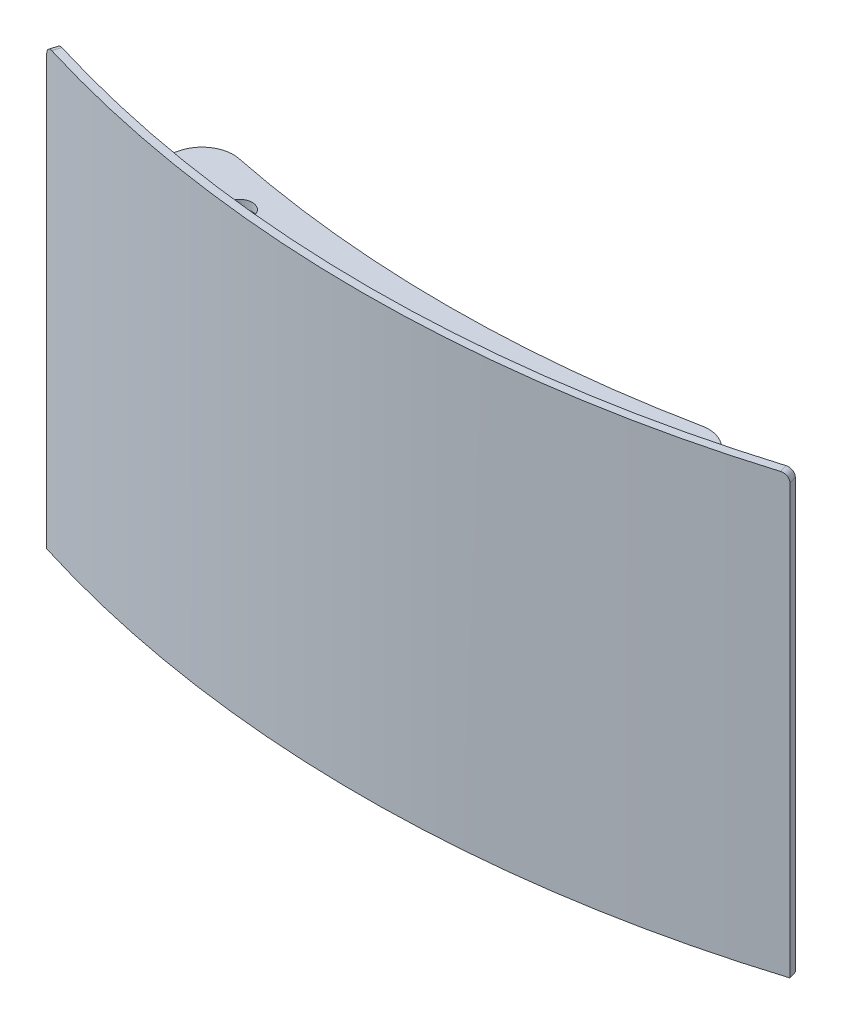
ISO-10303-21;
HEADER;
FILE_DESCRIPTION(('STEP AP214'),'2;1');
FILE_NAME('part.step','',(''),(''),'','','');
FILE_SCHEMA(('AUTOMOTIVE_DESIGN { 1 0 10303 214 1 1 1 1 }'));
ENDSEC;
DATA;
#1=APPLICATION_CONTEXT('core data for automotive mechanical design processes');
#2=APPLICATION_PROTOCOL_DEFINITION('international standard','automotive_design',2000,#1);
#3=PRODUCT_CONTEXT('',#1,'mechanical');
#4=PRODUCT('Part','Part','',(#3));
#5=PRODUCT_RELATED_PRODUCT_CATEGORY('part','',(#4));
#6=PRODUCT_DEFINITION_FORMATION('','',#4);
#7=PRODUCT_DEFINITION_CONTEXT('part definition',#1,'design');
#8=PRODUCT_DEFINITION('design','',#6,#7);
#9=PRODUCT_DEFINITION_SHAPE('','',#8);
#10=(LENGTH_UNIT() NAMED_UNIT(*) SI_UNIT(.MILLI.,.METRE.));
#11=(NAMED_UNIT(*) PLANE_ANGLE_UNIT() SI_UNIT($,.RADIAN.));
#12=(NAMED_UNIT(*) SI_UNIT($,.STERADIAN.) SOLID_ANGLE_UNIT());
#13=UNCERTAINTY_MEASURE_WITH_UNIT(LENGTH_MEASURE(1.E-05),#10,'distance_accuracy_value','');
#14=(GEOMETRIC_REPRESENTATION_CONTEXT(3) GLOBAL_UNCERTAINTY_ASSIGNED_CONTEXT((#13)) GLOBAL_UNIT_ASSIGNED_CONTEXT((#10,
#11,#12)) REPRESENTATION_CONTEXT('',''));
#15=CARTESIAN_POINT('',(0.,0.,0.));
#16=DIRECTION('',(0.,0.,1.));
#17=DIRECTION('',(1.,0.,0.));
#18=AXIS2_PLACEMENT_3D('',#15,#16,#17);
#19=CARTESIAN_POINT('',(76.2,233.685738606675,-242.300557159904));
#20=DIRECTION('',(0.,1.,0.));
#21=DIRECTION('',(0.,0.,1.));
#22=AXIS2_PLACEMENT_3D('',#19,#20,#21);
#23=CYLINDRICAL_SURFACE('',#22,253.238);
#24=CARTESIAN_POINT('',(76.2,466.09,-242.300557159904));
#25=DIRECTION('',(0.,1.,0.));
#26=DIRECTION('',(0.,0.,1.));
#27=AXIS2_PLACEMENT_3D('',#24,#25,#26);
#28=CIRCLE('',#27,253.238);
#29=CARTESIAN_POINT('',(19.4038398421802,466.09,4.48615406119721));
#30=VERTEX_POINT('',#29);
#31=CARTESIAN_POINT('',(132.797914432867,466.09,4.53169503953971));
#32=VERTEX_POINT('',#31);
#33=EDGE_CURVE('E239',#30,#32,#28,.T.);
#34=ORIENTED_EDGE('',*,*,#33,.T.);
#35=DIRECTION('',(0.,1.,0.));
#36=VECTOR('',#35,1.);
#37=CARTESIAN_POINT('',(132.797914432867,466.09,4.53169503953971));
#38=LINE('',#37,#36);
#39=CARTESIAN_POINT('',(132.797914432867,467.741,4.53169503953971));
#40=VERTEX_POINT('',#39);
#41=EDGE_CURVE('E229',#32,#40,#38,.T.);
#42=ORIENTED_EDGE('',*,*,#41,.T.);
#43=CARTESIAN_POINT('',(76.2,467.741,-242.300557159904));
#44=DIRECTION('',(0.,1.,0.));
#45=DIRECTION('',(0.,0.,1.));
#46=AXIS2_PLACEMENT_3D('',#43,#44,#45);
#47=CIRCLE('',#46,253.238);
#48=CARTESIAN_POINT('',(19.4038398421802,467.741,4.48615406119721));
#49=VERTEX_POINT('',#48);
#50=EDGE_CURVE('E233',#49,#40,#47,.T.);
#51=ORIENTED_EDGE('',*,*,#50,.F.);
#52=DIRECTION('',(0.,1.,0.));
#53=VECTOR('',#52,1.);
#54=CARTESIAN_POINT('',(19.4038398421802,233.685738606675,4.48615406119715));
#55=LINE('',#54,#53);
#56=EDGE_CURVE('E237',#30,#49,#55,.T.);
#57=ORIENTED_EDGE('',*,*,#56,.F.);
#58=EDGE_LOOP('',(#34,#42,#51,#57));
#59=FACE_BOUND('',#58,.T.);
#60=CARTESIAN_POINT('',(149.984613474908,478.78999680348,-0.0500350585918926));
#61=CARTESIAN_POINT('',(150.025635055923,478.79008434453,-0.062529339373361));
#62=CARTESIAN_POINT('',(150.066637317999,478.788361503138,-0.0750292643590371));
#63=CARTESIAN_POINT('',(150.14834923114,478.781313073592,-0.0999623829842916));
#64=CARTESIAN_POINT('',(150.189058896062,478.77598765722,-0.112395579777194));
#65=CARTESIAN_POINT('',(150.310236790901,478.754658465446,-0.149437923913108));
#66=CARTESIAN_POINT('',(150.389894762352,478.733301902024,-0.173832726889426));
#67=CARTESIAN_POINT('',(150.544613178669,478.676910613018,-0.221293890648153));
#68=CARTESIAN_POINT('',(150.619672225455,478.641871751632,-0.244359847333555));
#69=CARTESIAN_POINT('',(150.763086073832,478.559111342516,-0.288498639088332));
#70=CARTESIAN_POINT('',(150.831441661865,478.511391284971,-0.309571707950718));
#71=CARTESIAN_POINT('',(150.959518749024,478.404614372938,-0.349108510946142));
#72=CARTESIAN_POINT('',(151.019239101239,478.345556014942,-0.367571898460062));
#73=CARTESIAN_POINT('',(151.12834994497,478.217783792492,-0.401342014173826));
#74=CARTESIAN_POINT('',(151.177740432315,478.149069924139,-0.416648741098954));
#75=CARTESIAN_POINT('',(151.264791972761,478.003937603599,-0.443649598218896));
#76=CARTESIAN_POINT('',(151.30245371482,477.92751960431,-0.455343940608326));
#77=CARTESIAN_POINT('',(151.364992577912,477.769150419986,-0.474773563375211));
#78=CARTESIAN_POINT('',(151.389868202704,477.687198588646,-0.48250838040535));
#79=CARTESIAN_POINT('',(151.426114963946,477.520079612128,-0.49378173783047));
#80=CARTESIAN_POINT('',(151.437492476828,477.434914004753,-0.497322259586185));
#81=CARTESIAN_POINT('',(151.444215475846,477.306623775637,-0.499414319160306));
#82=CARTESIAN_POINT('',(151.444728636867,477.263733507965,-0.499573986092211));
#83=CARTESIAN_POINT('',(151.442305250064,477.178057883009,-0.498819903074743));
#84=CARTESIAN_POINT('',(151.439368536493,477.135272530865,-0.497906101550513));
#85=CARTESIAN_POINT('',(151.43471238162,477.092672643926,-0.496457325234673));
#86=B_SPLINE_CURVE_WITH_KNOTS('',3,(#60,#61,#62,#63,#64,#65,#66,#67,#68,#69,#70,#71,#72,#73,#74,
#75,#76,#77,#78,#79,#80,#81,#82,#83,#84,#85),.UNSPECIFIED.,.F.,.F.,(4,2,2,2,2,2,2,2,2,2,2,2,4),
(0.,0.128567636647668,0.257129143208204,0.513816086453091,0.770580679593902,1.0273151132709,
1.28408361455845,1.54085221953341,1.79760573882733,2.05438929679089,2.31105150326006,
2.43960053385237,2.56815574084342),.UNSPECIFIED.);
#87=CARTESIAN_POINT('',(149.98759953634,478.79,-0.0509445726708524));
#88=VERTEX_POINT('',#87);
#89=CARTESIAN_POINT('',(151.444154395946,477.266,-0.499395307362677));
#90=VERTEX_POINT('',#89);
#91=EDGE_CURVE('E128',#88,#90,#86,.T.);
#92=ORIENTED_EDGE('',*,*,#91,.T.);
#93=DIRECTION('',(0.,1.,0.));
#94=VECTOR('',#93,1.);
#95=CARTESIAN_POINT('',(151.444154395946,387.35,-0.499395307362677));
#96=LINE('',#95,#94);
#97=CARTESIAN_POINT('',(151.444154395946,389.89,-0.499395307362677));
#98=VERTEX_POINT('',#97);
#99=EDGE_CURVE('E122',#98,#90,#96,.T.);
#100=ORIENTED_EDGE('',*,*,#99,.F.);
#101=CARTESIAN_POINT('',(76.2,389.89,-242.300557159904));
#102=DIRECTION('',(0.,1.,0.));
#103=DIRECTION('',(0.,0.,1.));
#104=AXIS2_PLACEMENT_3D('',#101,#102,#103);
#105=CIRCLE('',#104,253.238);
#106=CARTESIAN_POINT('',(0.955845604053498,389.89,-0.499395307362704));
#107=VERTEX_POINT('',#106);
#108=EDGE_CURVE('E112',#107,#98,#105,.T.);
#109=ORIENTED_EDGE('',*,*,#108,.F.);
#110=DIRECTION('',(0.,1.,0.));
#111=VECTOR('',#110,1.);
#112=CARTESIAN_POINT('',(0.955845604053498,233.685738606675,-0.499395307362704));
#113=LINE('',#112,#111);
#114=CARTESIAN_POINT('',(0.955845604053512,477.266,-0.499395307362732));
#115=VERTEX_POINT('',#114);
#116=EDGE_CURVE('E134',#107,#115,#113,.T.);
#117=ORIENTED_EDGE('',*,*,#116,.T.);
#118=CARTESIAN_POINT('',(1.27601405075767,478.219638997539,-0.399997066551482));
#119=CARTESIAN_POINT('',(1.32718518822246,478.286409313736,-0.384147815834058));
#120=CARTESIAN_POINT('',(1.38378494189357,478.348704344154,-0.366634946235441));
#121=CARTESIAN_POINT('',(1.5062362107472,478.46251369786,-0.328801786420707));
#122=CARTESIAN_POINT('',(1.57209878280915,478.514014951105,-0.308478141515813));
#123=CARTESIAN_POINT('',(1.71114651502427,478.604691984424,-0.265641018824731));
#124=CARTESIAN_POINT('',(1.78432816235252,478.643873640283,-0.24312859169817));
#125=CARTESIAN_POINT('',(1.93594291920636,478.708815246287,-0.196569685131521));
#126=CARTESIAN_POINT('',(2.01437471986905,478.734578527672,-0.172523588105259));
#127=CARTESIAN_POINT('',(2.17429481142865,478.771972070359,-0.123583430832557));
#128=CARTESIAN_POINT('',(2.25578346002694,478.78360067232,-0.0986892713803987));
#129=CARTESIAN_POINT('',(2.41950004042234,478.792389158725,-0.0487670881155456));
#130=CARTESIAN_POINT('',(2.50172800129296,478.789548471656,-0.0237390590542363));
#131=CARTESIAN_POINT('',(2.66458778292469,478.769478013816,0.0257415350907573));
#132=CARTESIAN_POINT('',(2.74521956317143,478.752247878288,0.0501940855705685));
#133=CARTESIAN_POINT('',(2.90259348602752,478.703887372841,0.0978372371459949));
#134=CARTESIAN_POINT('',(2.97933563506682,478.672757025902,0.121027840327737));
#135=CARTESIAN_POINT('',(3.12675152522381,478.597477900204,0.165504250914672));
#136=CARTESIAN_POINT('',(3.1974249709338,478.553328488178,0.186789965597287));
#137=CARTESIAN_POINT('',(3.33068722546518,478.453264914841,0.226869638665179));
#138=CARTESIAN_POINT('',(3.39327604816833,478.397350773732,0.245663601328938));
#139=CARTESIAN_POINT('',(3.50858570141607,478.275344704856,0.28024703383554));
#140=CARTESIAN_POINT('',(3.56130655497023,478.209252800822,0.296036510684076));
#141=CARTESIAN_POINT('',(3.65537695509811,478.068766921911,0.324183396468107));
#142=CARTESIAN_POINT('',(3.69672649425454,477.994372941619,0.336540803164932));
#143=CARTESIAN_POINT('',(3.7668713739315,477.839400670869,0.357490034160984));
#144=CARTESIAN_POINT('',(3.79566765839612,477.758822845942,0.366082141592776));
#145=CARTESIAN_POINT('',(3.83988821305529,477.593765535907,0.379271839505266));
#146=CARTESIAN_POINT('',(3.85531249696114,477.509286054802,0.383869434081832));
#147=CARTESIAN_POINT('',(3.87234760369914,477.338832271281,0.388946988222835));
#148=CARTESIAN_POINT('',(3.8739597615106,477.252858114136,0.389427345729364));
#149=CARTESIAN_POINT('',(3.86332806355898,477.081847752047,0.386258647584373));
#150=CARTESIAN_POINT('',(3.85108420994752,476.996811546958,0.382609592574084));
#151=CARTESIAN_POINT('',(3.81309089778668,476.830093934232,0.371279738301627));
#152=CARTESIAN_POINT('',(3.78734189451704,476.748412413604,0.363599074951281));
#153=CARTESIAN_POINT('',(3.72307376717454,476.59071941955,0.344411726828827));
#154=CARTESIAN_POINT('',(3.68455463982346,476.514707947581,0.33290504107454));
#155=CARTESIAN_POINT('',(3.59584269164013,476.370507646648,0.306374152811633));
#156=CARTESIAN_POINT('',(3.54564915930766,476.302319294846,0.291349735913432));
#157=CARTESIAN_POINT('',(3.43502098932941,476.175705448165,0.258189949388763));
#158=CARTESIAN_POINT('',(3.37458634528645,476.117279959386,0.240054577819022));
#159=CARTESIAN_POINT('',(3.24519136793839,476.011844308814,0.201164683696954));
#160=CARTESIAN_POINT('',(3.17623019061304,475.964835278476,0.180409901851519));
#161=CARTESIAN_POINT('',(3.03175027454318,475.883574086785,0.136852415405017));
#162=CARTESIAN_POINT('',(2.95623153437357,475.849321928205,0.114049710358891));
#163=CARTESIAN_POINT('',(2.80078045526483,475.794545177987,0.0670269003498573));
#164=CARTESIAN_POINT('',(2.72084787855317,475.774021326674,0.0428067190235571));
#165=CARTESIAN_POINT('',(2.55884483084638,475.747286989836,-0.00637218534122177));
#166=CARTESIAN_POINT('',(2.47677435913571,475.741076509101,-0.0313309086268846));
#167=CARTESIAN_POINT('',(2.31282777507882,475.743145582677,-0.0812809491473035));
#168=CARTESIAN_POINT('',(2.23095165933814,475.751424882029,-0.106272265800822));
#169=CARTESIAN_POINT('',(2.06971565357482,475.782238381416,-0.155574356621849));
#170=CARTESIAN_POINT('',(1.99035576021326,475.804772562536,-0.1798851316924));
#171=CARTESIAN_POINT('',(1.83640596080783,475.863454898694,-0.227124057438863));
#172=CARTESIAN_POINT('',(1.76181581084923,475.899602356926,-0.250052278812258));
#173=CARTESIAN_POINT('',(1.61951363426209,475.984485507616,-0.293860460380876));
#174=CARTESIAN_POINT('',(1.55180161866555,476.033221220265,-0.314740417290835));
#175=CARTESIAN_POINT('',(1.42517460010667,476.141895340762,-0.353838790365762));
#176=CARTESIAN_POINT('',(1.3662592640648,476.201833324252,-0.372057307303551));
#177=CARTESIAN_POINT('',(1.2588884371964,476.331211911111,-0.405295509520559));
#178=CARTESIAN_POINT('',(1.21043296677717,476.400652533021,-0.420315188558816));
#179=CARTESIAN_POINT('',(1.12535094231252,476.547065678415,-0.446709341186652));
#180=CARTESIAN_POINT('',(1.08872449516359,476.624038269956,-0.458083781834942));
#181=CARTESIAN_POINT('',(1.02833694300876,476.783326773314,-0.476847149847997));
#182=CARTESIAN_POINT('',(1.0045753332599,476.865642475357,-0.484236233575433));
#183=CARTESIAN_POINT('',(0.970587430682216,477.033273993611,-0.494807747725036));
#184=CARTESIAN_POINT('',(0.960359750715976,477.118589501442,-0.497990609256844));
#185=CARTESIAN_POINT('',(0.953724533917358,477.289831244264,-0.50005532976753));
#186=CARTESIAN_POINT('',(0.957320431744127,477.375757625739,-0.498936119837242));
#187=CARTESIAN_POINT('',(0.978237858017621,477.545791754372,-0.492428136116246));
#188=CARTESIAN_POINT('',(0.995565962814057,477.62989861033,-0.487037316653192));
#189=CARTESIAN_POINT('',(1.04345897466009,477.793797077617,-0.472147726626133));
#190=CARTESIAN_POINT('',(1.07400793821866,477.873593756775,-0.46265390403462));
#191=CARTESIAN_POINT('',(1.13363682358356,477.997901253199,-0.444140393066684));
#192=CARTESIAN_POINT('',(1.15897202181626,478.044423242975,-0.43627786970847));
#193=CARTESIAN_POINT('',(1.214169279329,478.134425901235,-0.419159213639868));
#194=CARTESIAN_POINT('',(1.24403133863116,478.177906569703,-0.409903080922671));
#195=CARTESIAN_POINT('',(1.27601405075767,478.219638997539,-0.399997066551482));
#196=B_SPLINE_CURVE_WITH_KNOTS('',3,(#118,#119,#120,#121,#122,#123,#124,#125,#126,#127,#128,
#129,#130,#131,#132,#133,#134,#135,#136,#137,#138,#139,#140,#141,#142,#143,#144,#145,#146,#147,
#148,#149,#150,#151,#152,#153,#154,#155,#156,#157,#158,#159,#160,#161,#162,#163,#164,#165,#166,
#167,#168,#169,#170,#171,#172,#173,#174,#175,#176,#177,#178,#179,#180,#181,#182,#183,#184,#185,
#186,#187,#188,#189,#190,#191,#192,#193,#194,#195),.UNSPECIFIED.,.T.,.F.,(4,2,2,2,2,2,2,2,2,2,2,
2,2,2,2,2,2,2,2,2,2,2,2,2,2,2,2,2,2,2,2,2,2,2,2,2,2,2,4),(0.,0.256615211948305,
0.513539383163429,0.770340828835658,1.02707849065314,1.28384628928317,1.54062422987672,
1.79740867969215,2.05419270500403,2.3109892227746,2.56778529960496,2.82458077764518,
3.08137642318751,3.3381527556061,3.59492882473276,3.85168007547833,4.10843128635453,
4.36517384230174,4.62191646415749,4.87867473737362,5.13543317097563,5.39221704083224,
5.64900096649372,5.90579873857683,6.16259659660911,6.41938993613199,6.67618293488712,
6.93296279126571,7.18974305949329,7.44651360246569,7.70328464639516,7.96005801064767,
8.2168212998452,8.47355827048137,8.73035903509215,8.98728285588306,9.24389770295236,
9.4042859768415,9.56467425151438),.UNSPECIFIED.);
#197=CARTESIAN_POINT('',(2.41240046365943,478.79,-0.0509445726708246));
#198=VERTEX_POINT('',#197);
#199=EDGE_CURVE('E147',#115,#198,#196,.T.);
#200=ORIENTED_EDGE('',*,*,#199,.T.);
#201=CARTESIAN_POINT('',(76.2,478.79,-242.300557159904));
#202=DIRECTION('',(0.,1.,0.));
#203=DIRECTION('',(0.,0.,1.));
#204=AXIS2_PLACEMENT_3D('',#201,#202,#203);
#205=CIRCLE('',#204,253.238);
#206=EDGE_CURVE('E219',#88,#198,#205,.F.);
#207=ORIENTED_EDGE('',*,*,#206,.F.);
#208=EDGE_LOOP('',(#92,#100,#109,#117,#200,#207));
#209=FACE_BOUND('',#208,.T.);
#210=ADVANCED_FACE('F39',(#59,#209),#23,.F.);
#211=CARTESIAN_POINT('',(151.21589832852,233.685738606675,-1.22520334295942));
#212=DIRECTION('',(0.95393920141695,0.,-0.299999999999987));
#213=DIRECTION('',(-0.299999999999987,0.,-0.95393920141695));
#214=AXIS2_PLACEMENT_3D('',#211,#212,#213);
#215=PLANE('',#214);
#216=ORIENTED_EDGE('',*,*,#99,.T.);
#217=DIRECTION('',(-0.299999999999987,0.,-0.95393920141695));
#218=VECTOR('',#217,1.);
#219=CARTESIAN_POINT('',(151.21589832852,477.266,-1.22520334295942));
#220=LINE('',#219,#218);
#221=CARTESIAN_POINT('',(151.939456623721,477.266,1.07556539804829));
#222=VERTEX_POINT('',#221);
#223=EDGE_CURVE('E153',#90,#222,#220,.F.);
#224=ORIENTED_EDGE('',*,*,#223,.T.);
#225=DIRECTION('',(0.,1.,0.));
#226=VECTOR('',#225,1.);
#227=CARTESIAN_POINT('',(151.939456623721,233.685738606675,1.07556539804829));
#228=LINE('',#227,#226);
#229=CARTESIAN_POINT('',(151.939456623721,389.89,1.07556539804829));
#230=VERTEX_POINT('',#229);
#231=EDGE_CURVE('E125',#230,#222,#228,.T.);
#232=ORIENTED_EDGE('',*,*,#231,.F.);
#233=DIRECTION('',(0.299999999999987,0.,0.95393920141695));
#234=VECTOR('',#233,1.);
#235=CARTESIAN_POINT('',(151.21589832852,389.89,-1.22520334295942));
#236=LINE('',#235,#234);
#237=EDGE_CURVE('E43',#98,#230,#236,.T.);
#238=ORIENTED_EDGE('',*,*,#237,.F.);
#239=EDGE_LOOP('',(#216,#224,#232,#238));
#240=FACE_BOUND('',#239,.T.);
#241=ADVANCED_FACE('F121',(#240),#215,.T.);
#242=CARTESIAN_POINT('',(76.2,233.685738606675,-242.300557159904));
#243=DIRECTION('',(0.,1.,0.));
#244=DIRECTION('',(0.,0.,1.));
#245=AXIS2_PLACEMENT_3D('',#242,#243,#244);
#246=CYLINDRICAL_SURFACE('',#245,254.889);
#247=ORIENTED_EDGE('',*,*,#231,.T.);
#248=CARTESIAN_POINT('',(151.939456623721,477.266,1.07556539804829));
#249=CARTESIAN_POINT('',(151.939456332719,477.308877124114,1.07556542306595));
#250=CARTESIAN_POINT('',(151.937727769913,477.35173370679,1.07610343024965));
#251=CARTESIAN_POINT('',(151.930831708128,477.437140197982,1.07824937244954));
#252=CARTESIAN_POINT('',(151.925664374078,477.479690121107,1.07985725615261));
#253=CARTESIAN_POINT('',(151.905053058295,477.606348338713,1.08626968855139));
#254=CARTESIAN_POINT('',(151.88449962778,477.689608224061,1.09266306404891));
#255=CARTESIAN_POINT('',(151.830334370593,477.851330152456,1.10949940876609));
#256=CARTESIAN_POINT('',(151.796716274564,477.929789871086,1.1199443221978));
#257=CARTESIAN_POINT('',(151.717374609847,478.079683282114,1.14457047995282));
#258=CARTESIAN_POINT('',(151.671653174265,478.151118209528,1.15875106589488));
#259=CARTESIAN_POINT('',(151.569396158558,478.284934375345,1.19042686205076));
#260=CARTESIAN_POINT('',(151.512860704011,478.347315718868,1.20792203377392));
#261=CARTESIAN_POINT('',(151.39055855872,478.461270808769,1.24571423840585));
#262=CARTESIAN_POINT('',(151.32479006609,478.512842440652,1.2660118182098));
#263=CARTESIAN_POINT('',(151.185887669455,478.603705039145,1.30881098713732));
#264=CARTESIAN_POINT('',(151.112752331339,478.642993608466,1.33131300537762));
#265=CARTESIAN_POINT('',(150.961207112812,478.708146816555,1.37785898975574));
#266=CARTESIAN_POINT('',(150.882800349275,478.734019310449,1.40190204432766));
#267=CARTESIAN_POINT('',(150.750415466838,478.765177813526,1.44242406413657));
#268=CARTESIAN_POINT('',(150.697276842633,478.774480536663,1.45867068267718));
#269=CARTESIAN_POINT('',(150.590407944935,478.786890810666,1.49130627156386));
#270=CARTESIAN_POINT('',(150.536678619403,478.790007145487,1.50769500684054));
#271=CARTESIAN_POINT('',(150.482919587394,478.79,1.52407280715391));
#272=B_SPLINE_CURVE_WITH_KNOTS('',3,(#248,#249,#250,#251,#252,#253,#254,#255,#256,#257,#258,
#259,#260,#261,#262,#263,#264,#265,#266,#267,#268,#269,#270,#271),.UNSPECIFIED.,.F.,.F.,(4,2,2,
2,2,2,2,2,2,2,2,4),(0.,0.128552363598693,0.257098562049406,0.513766996766635,0.770558751675988,
1.027305279414,1.28404882586229,1.54084254730122,1.79768635599678,2.0543796120767,
2.22307919875201,2.39153907976338),.UNSPECIFIED.);
#273=CARTESIAN_POINT('',(150.482919587394,478.79,1.52407280715391));
#274=VERTEX_POINT('',#273);
#275=EDGE_CURVE('E160',#222,#274,#272,.T.);
#276=ORIENTED_EDGE('',*,*,#275,.T.);
#277=CARTESIAN_POINT('',(76.2,478.79,-242.300557159904));
#278=DIRECTION('',(0.,1.,0.));
#279=DIRECTION('',(0.,0.,1.));
#280=AXIS2_PLACEMENT_3D('',#277,#278,#279);
#281=CIRCLE('',#280,254.889);
#282=CARTESIAN_POINT('',(1.9170804126063,478.79,1.52407280715394));
#283=VERTEX_POINT('',#282);
#284=EDGE_CURVE('E199',#283,#274,#281,.T.);
#285=ORIENTED_EDGE('',*,*,#284,.F.);
#286=CARTESIAN_POINT('',(1.00920195405062,478.457993667964,1.24563190946567));
#287=CARTESIAN_POINT('',(0.945229081407379,478.404652467436,1.2258813468331));
#288=CARTESIAN_POINT('',(0.885521572343381,478.345618341682,1.20741992393052));
#289=CARTESIAN_POINT('',(0.776384914247207,478.217845218768,1.1736383745462));
#290=CARTESIAN_POINT('',(0.726968225834522,478.149094623509,1.15832205661753));
#291=CARTESIAN_POINT('',(0.639889193563296,478.003908616768,1.13131022513217));
#292=CARTESIAN_POINT('',(0.602221252186886,477.927476887871,1.11961298733935));
#293=CARTESIAN_POINT('',(0.539688653760137,477.769097173106,1.1001837731972));
#294=CARTESIAN_POINT('',(0.514820819401116,477.687150561889,1.09245081281638));
#295=CARTESIAN_POINT('',(0.478571936798814,477.520039270849,1.08117596116129));
#296=CARTESIAN_POINT('',(0.467192314661576,477.434874251728,1.07763451305486));
#297=CARTESIAN_POINT('',(0.458246348232806,477.263748891544,1.07485059065209));
#298=CARTESIAN_POINT('',(0.460680546072394,477.1777885194,1.07560828507801));
#299=CARTESIAN_POINT('',(0.479294431638016,477.007517313621,1.08140018737633));
#300=CARTESIAN_POINT('',(0.495473889518519,476.923206452428,1.0864343237389));
#301=CARTESIAN_POINT('',(0.541121229279496,476.758626325135,1.10062802755717));
#302=CARTESIAN_POINT('',(0.570589084445796,476.67835705091,1.10978758671937));
#303=CARTESIAN_POINT('',(0.641981099074564,476.524138442334,1.13195811042582));
#304=CARTESIAN_POINT('',(0.683905271773764,476.450189114699,1.14496907906279));
#305=CARTESIAN_POINT('',(0.77902541152638,476.310709842561,1.17445466672891));
#306=CARTESIAN_POINT('',(0.832221357761556,476.245179882509,1.19092927936093));
#307=CARTESIAN_POINT('',(0.948381227502275,476.124399512627,1.22685378205322));
#308=CARTESIAN_POINT('',(1.0113451275384,476.0691490781,1.24630366496481));
#309=CARTESIAN_POINT('',(1.14526000060226,475.970495815089,1.28760598843925));
#310=CARTESIAN_POINT('',(1.21621098173941,475.927092998635,1.30945843144146));
#311=CARTESIAN_POINT('',(1.36409163260693,475.853366807666,1.35492731957512));
#312=CARTESIAN_POINT('',(1.44102132014411,475.823043472107,1.37854376996045));
#313=CARTESIAN_POINT('',(1.59867956638976,475.776336893674,1.42685636478463));
#314=CARTESIAN_POINT('',(1.67940812396979,475.759953646659,1.45155250890278));
#315=CARTESIAN_POINT('',(1.84237709384885,475.741591637624,1.5013162821548));
#316=CARTESIAN_POINT('',(1.92461754507067,475.739613246971,1.52638392084935));
#317=CARTESIAN_POINT('',(2.08827419871946,475.750117682741,1.57617755783352));
#318=CARTESIAN_POINT('',(2.16969040077715,475.762600515642,1.60090355597009));
#319=CARTESIAN_POINT('',(2.32938980259919,475.801673759997,1.64931932369366));
#320=CARTESIAN_POINT('',(2.40767284856875,475.828264863062,1.67300904241891));
#321=CARTESIAN_POINT('',(2.55887594330801,475.894800177197,1.71869087673635));
#322=CARTESIAN_POINT('',(2.63179599068691,475.93474439173,1.74068299188829));
#323=CARTESIAN_POINT('',(2.77020044646156,476.026853905801,1.78236336111463));
#324=CARTESIAN_POINT('',(2.83568459025685,476.079019640029,1.80205153320589));
#325=CARTESIAN_POINT('',(2.9573489393875,476.194090915067,1.83858437566609));
#326=CARTESIAN_POINT('',(3.01352914499267,476.256996455566,1.85542904611749));
#327=CARTESIAN_POINT('',(3.11498253529863,476.391760100321,1.88581706242856));
#328=CARTESIAN_POINT('',(3.16025601692197,476.463617960779,1.89936049816053));
#329=CARTESIAN_POINT('',(3.23860614857395,476.614247892156,1.92278121621987));
#330=CARTESIAN_POINT('',(3.27168280657881,476.693019958554,1.93265850094475));
#331=CARTESIAN_POINT('',(3.32469249140714,476.855234640011,1.94848101018518));
#332=CARTESIAN_POINT('',(3.34462670247479,476.938676833518,1.95442658898039));
#333=CARTESIAN_POINT('',(3.37078687970153,477.107869358736,1.96222802523745));
#334=CARTESIAN_POINT('',(3.37701284799257,477.193619690088,1.96408388333534));
#335=CARTESIAN_POINT('',(3.37557872378468,477.364986683353,1.96365632045804));
#336=CARTESIAN_POINT('',(3.36791978188388,477.450603355754,1.96137324246327));
#337=CARTESIAN_POINT('',(3.33893688973727,477.619279631807,1.95272946899674));
#338=CARTESIAN_POINT('',(3.31761295511394,477.702339238381,1.94636877818671));
#339=CARTESIAN_POINT('',(3.26190907715321,477.86354375712,1.92974000382152));
#340=CARTESIAN_POINT('',(3.22752915061363,477.941688675608,1.9194719252936));
#341=CARTESIAN_POINT('',(3.14669445039638,478.090846378823,1.89530406875841));
#342=CARTESIAN_POINT('',(3.10023964958568,478.161859147523,1.88140428259044));
#343=CARTESIAN_POINT('',(2.99657595566871,478.294742764179,1.85034688993692));
#344=CARTESIAN_POINT('',(2.93936619972517,478.356612877937,1.83318902206429));
#345=CARTESIAN_POINT('',(2.81582539957165,478.469448917388,1.79608228885109));
#346=CARTESIAN_POINT('',(2.74949433208642,478.520414815255,1.77613341638859));
#347=CARTESIAN_POINT('',(2.60959217591747,478.610001055797,1.73398860592779));
#348=CARTESIAN_POINT('',(2.53602029760532,478.648620050056,1.71179242284707));
#349=CARTESIAN_POINT('',(2.38373898214905,478.712407360833,1.66576889912016));
#350=CARTESIAN_POINT('',(2.30502974567767,478.737576202382,1.6419416221851));
#351=CARTESIAN_POINT('',(2.14471553136808,478.773750041961,1.5933217620617));
#352=CARTESIAN_POINT('',(2.06311077383954,478.784756115219,1.56852925230052));
#353=CARTESIAN_POINT('',(1.89929467005552,478.792294579013,1.51866857653885));
#354=CARTESIAN_POINT('',(1.81708317821992,478.788823375173,1.49360034362362));
#355=CARTESIAN_POINT('',(1.6543806333485,478.767498539197,1.44389959473877));
#356=CARTESIAN_POINT('',(1.57389035809156,478.749638540411,1.41926727658129));
#357=CARTESIAN_POINT('',(1.41701403163459,478.700042681977,1.37117704301165));
#358=CARTESIAN_POINT('',(1.3406231600701,478.668323538948,1.34771775059248));
#359=CARTESIAN_POINT('',(1.22159699844691,478.606307922453,1.31110864151011));
#360=CARTESIAN_POINT('',(1.17704570564067,478.579938332659,1.2973916954383));
#361=CARTESIAN_POINT('',(1.09084144418628,478.522451779653,1.27082591683014));
#362=CARTESIAN_POINT('',(1.04918847543819,478.491334816604,1.25797708426387));
#363=CARTESIAN_POINT('',(1.00920195405062,478.457993667964,1.24563190946567));
#364=B_SPLINE_CURVE_WITH_KNOTS('',3,(#286,#287,#288,#289,#290,#291,#292,#293,#294,#295,#296,
#297,#298,#299,#300,#301,#302,#303,#304,#305,#306,#307,#308,#309,#310,#311,#312,#313,#314,#315,
#316,#317,#318,#319,#320,#321,#322,#323,#324,#325,#326,#327,#328,#329,#330,#331,#332,#333,#334,
#335,#336,#337,#338,#339,#340,#341,#342,#343,#344,#345,#346,#347,#348,#349,#350,#351,#352,#353,
#354,#355,#356,#357,#358,#359,#360,#361,#362,#363),.UNSPECIFIED.,.T.,.F.,(4,2,2,2,2,2,2,2,2,2,2,
2,2,2,2,2,2,2,2,2,2,2,2,2,2,2,2,2,2,2,2,2,2,2,2,2,2,2,4),(0.,0.256614109889038,
0.513537156600469,0.770337608460403,1.02707428520779,1.2838381042532,1.54061200020851,
1.79738160252583,2.05415068865167,2.31092004763466,2.56768893238531,2.82445720020795,
3.08122572873375,3.33799502204175,3.59476423907865,3.85154007576716,4.10831602748921,
4.36510456795124,4.62189317500648,4.87869091680968,5.13548865116588,5.39227939372007,
5.64906996834373,5.90583740082943,6.16260479338185,6.41935090941338,6.67609673192061,
6.93284222410028,7.18958829320913,7.44635496907014,7.70312230014658,7.95991766343163,
8.21670300191028,8.47346884424652,8.73029843941483,8.98724173713285,9.24387596694168,
9.40427373435916,9.56467149624572),.UNSPECIFIED.);
#365=CARTESIAN_POINT('',(0.46054337627896,477.266,1.07556539804823));
#366=VERTEX_POINT('',#365);
#367=EDGE_CURVE('E155',#283,#366,#364,.T.);
#368=ORIENTED_EDGE('',*,*,#367,.T.);
#369=DIRECTION('',(0.,1.,0.));
#370=VECTOR('',#369,1.);
#371=CARTESIAN_POINT('',(0.460543376278946,233.685738606675,1.07556539804826));
#372=LINE('',#371,#370);
#373=CARTESIAN_POINT('',(0.460543376278946,389.89,1.07556539804826));
#374=VERTEX_POINT('',#373);
#375=EDGE_CURVE('E131',#374,#366,#372,.T.);
#376=ORIENTED_EDGE('',*,*,#375,.F.);
#377=CARTESIAN_POINT('',(76.2,389.89,-242.300557159904));
#378=DIRECTION('',(0.,1.,0.));
#379=DIRECTION('',(0.,0.,1.));
#380=AXIS2_PLACEMENT_3D('',#377,#378,#379);
#381=CIRCLE('',#380,254.889);
#382=EDGE_CURVE('E126',#230,#374,#381,.F.);
#383=ORIENTED_EDGE('',*,*,#382,.F.);
#384=EDGE_LOOP('',(#247,#276,#285,#368,#376,#383));
#385=FACE_BOUND('',#384,.T.);
#386=ADVANCED_FACE('F201',(#385),#246,.T.);
#387=CARTESIAN_POINT('',(1.18410167147961,233.685738606675,-1.22520334295944));
#388=DIRECTION('',(-0.953939201416947,0.,-0.299999999999997));
#389=DIRECTION('',(-0.299999999999997,0.,0.953939201416947));
#390=AXIS2_PLACEMENT_3D('',#387,#388,#389);
#391=PLANE('',#390);
#392=DIRECTION('',(-0.299999999999997,0.,0.953939201416947));
#393=VECTOR('',#392,1.);
#394=CARTESIAN_POINT('',(1.18410167147961,477.266,-1.22520334295944));
#395=LINE('',#394,#393);
#396=EDGE_CURVE('E156',#366,#115,#395,.F.);
#397=ORIENTED_EDGE('',*,*,#396,.T.);
#398=ORIENTED_EDGE('',*,*,#116,.F.);
#399=DIRECTION('',(0.299999999999997,0.,-0.953939201416947));
#400=VECTOR('',#399,1.);
#401=CARTESIAN_POINT('',(1.18410167147961,389.89,-1.22520334295944));
#402=LINE('',#401,#400);
#403=EDGE_CURVE('E114',#374,#107,#402,.T.);
#404=ORIENTED_EDGE('',*,*,#403,.F.);
#405=ORIENTED_EDGE('',*,*,#375,.T.);
#406=EDGE_LOOP('',(#397,#398,#404,#405));
#407=FACE_BOUND('',#406,.T.);
#408=ADVANCED_FACE('F273',(#407),#391,.T.);
#409=CARTESIAN_POINT('',(76.2,389.89,-242.300557159904));
#410=DIRECTION('',(0.,1.,0.));
#411=DIRECTION('',(0.,0.,1.));
#412=AXIS2_PLACEMENT_3D('',#409,#410,#411);
#413=PLANE('',#412);
#414=ORIENTED_EDGE('',*,*,#108,.T.);
#415=ORIENTED_EDGE('',*,*,#237,.T.);
#416=ORIENTED_EDGE('',*,*,#382,.T.);
#417=ORIENTED_EDGE('',*,*,#403,.T.);
#418=EDGE_LOOP('',(#414,#415,#416,#417));
#419=FACE_BOUND('',#418,.T.);
#420=ADVANCED_FACE('F41',(#419),#413,.F.);
#421=CARTESIAN_POINT('',(0.,478.79,0.));
#422=DIRECTION('',(0.,1.,0.));
#423=DIRECTION('',(-1.,0.,0.));
#424=AXIS2_PLACEMENT_3D('',#421,#422,#423);
#425=PLANE('',#424);
#426=ORIENTED_EDGE('',*,*,#284,.T.);
#427=DIRECTION('',(-0.299999999999987,0.,-0.95393920141695));
#428=VECTOR('',#427,1.);
#429=CARTESIAN_POINT('',(136.503294985562,478.79,-42.928300288781));
#430=LINE('',#429,#428);
#431=EDGE_CURVE('E139',#274,#88,#430,.T.);
#432=ORIENTED_EDGE('',*,*,#431,.T.);
#433=ORIENTED_EDGE('',*,*,#206,.T.);
#434=DIRECTION('',(-0.299999999999997,0.,0.953939201416947));
#435=VECTOR('',#434,1.);
#436=CARTESIAN_POINT('',(2.18070501443904,478.79,0.685799999999987));
#437=LINE('',#436,#435);
#438=EDGE_CURVE('E137',#198,#283,#437,.T.);
#439=ORIENTED_EDGE('',*,*,#438,.T.);
#440=EDGE_LOOP('',(#426,#432,#433,#439));
#441=FACE_BOUND('',#440,.T.);
#442=ADVANCED_FACE('F248',(#441),#425,.T.);
#443=CARTESIAN_POINT('',(76.2,468.63,-242.300557159904));
#444=DIRECTION('',(0.,-1.,0.));
#445=DIRECTION('',(0.,0.,-1.));
#446=AXIS2_PLACEMENT_3D('',#443,#444,#445);
#447=CYLINDRICAL_SURFACE('',#446,237.49);
#448=CARTESIAN_POINT('',(76.2,467.741,-242.300557159904));
#449=DIRECTION('',(0.,1.,0.));
#450=DIRECTION('',(0.,0.,1.));
#451=AXIS2_PLACEMENT_3D('',#448,#449,#450);
#452=CIRCLE('',#451,237.49);
#453=CARTESIAN_POINT('',(123.341279141216,467.741,-9.53629894801741));
#454=VERTEX_POINT('',#453);
#455=CARTESIAN_POINT('',(28.9809423485542,467.741,-9.55206480279053));
#456=VERTEX_POINT('',#455);
#457=EDGE_CURVE('E150',#454,#456,#452,.F.);
#458=ORIENTED_EDGE('',*,*,#457,.F.);
#459=DIRECTION('',(0.,-1.,0.));
#460=VECTOR('',#459,1.);
#461=CARTESIAN_POINT('',(123.341279141216,468.63,-9.53629894801741));
#462=LINE('',#461,#460);
#463=CARTESIAN_POINT('',(123.341279141216,466.09,-9.53629894801741));
#464=VERTEX_POINT('',#463);
#465=EDGE_CURVE('E176',#454,#464,#462,.T.);
#466=ORIENTED_EDGE('',*,*,#465,.T.);
#467=CARTESIAN_POINT('',(76.2,466.09,-242.300557159904));
#468=DIRECTION('',(0.,-1.,0.));
#469=DIRECTION('',(0.,0.,1.));
#470=AXIS2_PLACEMENT_3D('',#467,#468,#469);
#471=CIRCLE('',#470,237.49);
#472=CARTESIAN_POINT('',(28.9809423485542,466.09,-9.55206480279053));
#473=VERTEX_POINT('',#472);
#474=EDGE_CURVE('E236',#464,#473,#471,.T.);
#475=ORIENTED_EDGE('',*,*,#474,.T.);
#476=DIRECTION('',(0.,-1.,0.));
#477=VECTOR('',#476,1.);
#478=CARTESIAN_POINT('',(28.9809423485542,468.63,-9.55206480279053));
#479=LINE('',#478,#477);
#480=EDGE_CURVE('E173',#473,#456,#479,.F.);
#481=ORIENTED_EDGE('',*,*,#480,.T.);
#482=EDGE_LOOP('',(#458,#466,#475,#481));
#483=FACE_BOUND('',#482,.T.);
#484=ADVANCED_FACE('F260',(#483),#447,.F.);
#485=CARTESIAN_POINT('',(76.2,467.741,-242.300557159904));
#486=DIRECTION('',(0.,1.,0.));
#487=DIRECTION('',(0.,0.,1.));
#488=AXIS2_PLACEMENT_3D('',#485,#486,#487);
#489=PLANE('',#488);
#490=CARTESIAN_POINT('',(38.1,467.741,-0.635830287159411));
#491=DIRECTION('',(0.,1.,0.));
#492=DIRECTION('',(0.,0.,1.));
#493=AXIS2_PLACEMENT_3D('',#490,#491,#492);
#494=CIRCLE('',#493,2.54);
#495=CARTESIAN_POINT('',(38.1,467.741,1.90416971284059));
#496=VERTEX_POINT('',#495);
#497=EDGE_CURVE('E190',#496,#496,#494,.T.);
#498=ORIENTED_EDGE('',*,*,#497,.F.);
#499=EDGE_LOOP('',(#498));
#500=FACE_BOUND('',#499,.T.);
#501=CARTESIAN_POINT('',(114.3,467.741,-0.635830287159467));
#502=DIRECTION('',(0.,1.,0.));
#503=DIRECTION('',(0.,0.,1.));
#504=AXIS2_PLACEMENT_3D('',#501,#502,#503);
#505=CIRCLE('',#504,2.54);
#506=CARTESIAN_POINT('',(114.3,467.741,1.90416971284053));
#507=VERTEX_POINT('',#506);
#508=EDGE_CURVE('E187',#507,#507,#505,.T.);
#509=ORIENTED_EDGE('',*,*,#508,.F.);
#510=EDGE_LOOP('',(#509));
#511=FACE_BOUND('',#510,.T.);
#512=DIRECTION('',(0.211674581544198,0.,0.977340202553895));
#513=VECTOR('',#512,1.);
#514=CARTESIAN_POINT('',(129.464202354625,467.741,-10.8606624841472));
#515=LINE('',#514,#513);
#516=CARTESIAN_POINT('',(130.807851436557,467.741,-4.65678927312555));
#517=VERTEX_POINT('',#516);
#518=EDGE_CURVE('E186',#517,#40,#515,.T.);
#519=ORIENTED_EDGE('',*,*,#518,.F.);
#520=CARTESIAN_POINT('',(124.60174115034,467.741,-3.31265568031988));
#521=DIRECTION('',(0.,1.,0.));
#522=DIRECTION('',(0.,0.,1.));
#523=AXIS2_PLACEMENT_3D('',#520,#521,#522);
#524=CIRCLE('',#523,6.35);
#525=EDGE_CURVE('E170',#517,#454,#524,.T.);
#526=ORIENTED_EDGE('',*,*,#525,.T.);
#527=ORIENTED_EDGE('',*,*,#457,.T.);
#528=CARTESIAN_POINT('',(27.7184007001198,467.741,-3.32884308201212));
#529=DIRECTION('',(0.,1.,0.));
#530=DIRECTION('',(0.,0.,1.));
#531=AXIS2_PLACEMENT_3D('',#528,#529,#530);
#532=CIRCLE('',#531,6.35);
#533=CARTESIAN_POINT('',(21.5301682221584,467.741,-4.75301961555825));
#534=VERTEX_POINT('',#533);
#535=EDGE_CURVE('E167',#456,#534,#532,.T.);
#536=ORIENTED_EDGE('',*,*,#535,.T.);
#537=DIRECTION('',(0.224279769062383,0.,-0.974524799678964));
#538=VECTOR('',#537,1.);
#539=CARTESIAN_POINT('',(22.9357976453746,467.741,-10.8606624841472));
#540=LINE('',#539,#538);
#541=EDGE_CURVE('E232',#49,#534,#540,.T.);
#542=ORIENTED_EDGE('',*,*,#541,.F.);
#543=ORIENTED_EDGE('',*,*,#50,.T.);
#544=EDGE_LOOP('',(#519,#526,#527,#536,#542,#543));
#545=FACE_BOUND('',#544,.T.);
#546=ADVANCED_FACE('F254',(#500,#511,#545),#489,.T.);
#547=CARTESIAN_POINT('',(76.2,466.09,-242.300557159904));
#548=DIRECTION('',(0.,1.,0.));
#549=DIRECTION('',(0.,0.,1.));
#550=AXIS2_PLACEMENT_3D('',#547,#548,#549);
#551=PLANE('',#550);
#552=CARTESIAN_POINT('',(38.1,466.09,-0.635830287159411));
#553=DIRECTION('',(0.,1.,0.));
#554=DIRECTION('',(0.,0.,1.));
#555=AXIS2_PLACEMENT_3D('',#552,#553,#554);
#556=CIRCLE('',#555,2.54);
#557=CARTESIAN_POINT('',(38.1,466.09,1.90416971284059));
#558=VERTEX_POINT('',#557);
#559=EDGE_CURVE('E188',#558,#558,#556,.T.);
#560=ORIENTED_EDGE('',*,*,#559,.T.);
#561=EDGE_LOOP('',(#560));
#562=FACE_BOUND('',#561,.T.);
#563=CARTESIAN_POINT('',(114.3,466.09,-0.635830287159467));
#564=DIRECTION('',(0.,1.,0.));
#565=DIRECTION('',(0.,0.,1.));
#566=AXIS2_PLACEMENT_3D('',#563,#564,#565);
#567=CIRCLE('',#566,2.54);
#568=CARTESIAN_POINT('',(114.3,466.09,1.90416971284053));
#569=VERTEX_POINT('',#568);
#570=EDGE_CURVE('E183',#569,#569,#567,.T.);
#571=ORIENTED_EDGE('',*,*,#570,.T.);
#572=EDGE_LOOP('',(#571));
#573=FACE_BOUND('',#572,.T.);
#574=ORIENTED_EDGE('',*,*,#474,.F.);
#575=CARTESIAN_POINT('',(124.60174115034,466.09,-3.31265568031988));
#576=DIRECTION('',(0.,1.,0.));
#577=DIRECTION('',(0.,0.,1.));
#578=AXIS2_PLACEMENT_3D('',#575,#576,#577);
#579=CIRCLE('',#578,6.35);
#580=CARTESIAN_POINT('',(130.807851436557,466.09,-4.65678927312549));
#581=VERTEX_POINT('',#580);
#582=EDGE_CURVE('E49',#464,#581,#579,.F.);
#583=ORIENTED_EDGE('',*,*,#582,.T.);
#584=DIRECTION('',(0.211674581544198,0.,0.977340202553895));
#585=VECTOR('',#584,1.);
#586=CARTESIAN_POINT('',(79.1977989849073,466.09,-242.949827336272));
#587=LINE('',#586,#585);
#588=EDGE_CURVE('E162',#581,#32,#587,.T.);
#589=ORIENTED_EDGE('',*,*,#588,.T.);
#590=ORIENTED_EDGE('',*,*,#33,.F.);
#591=DIRECTION('',(0.224279769062383,0.,-0.974524799678964));
#592=VECTOR('',#591,1.);
#593=CARTESIAN_POINT('',(76.1999999999999,466.09,-242.300557159904));
#594=LINE('',#593,#592);
#595=CARTESIAN_POINT('',(21.5301682221584,466.09,-4.75301961555816));
#596=VERTEX_POINT('',#595);
#597=EDGE_CURVE('E159',#30,#596,#594,.T.);
#598=ORIENTED_EDGE('',*,*,#597,.T.);
#599=CARTESIAN_POINT('',(27.7184007001198,466.09,-3.32884308201212));
#600=DIRECTION('',(0.,1.,0.));
#601=DIRECTION('',(0.,0.,1.));
#602=AXIS2_PLACEMENT_3D('',#599,#600,#601);
#603=CIRCLE('',#602,6.35);
#604=EDGE_CURVE('E179',#596,#473,#603,.F.);
#605=ORIENTED_EDGE('',*,*,#604,.T.);
#606=EDGE_LOOP('',(#574,#583,#589,#590,#598,#605));
#607=FACE_BOUND('',#606,.T.);
#608=ADVANCED_FACE('F250',(#562,#573,#607),#551,.F.);
#609=CARTESIAN_POINT('',(136.503294985562,477.266,-42.928300288781));
#610=DIRECTION('',(-0.299999999999987,0.,-0.95393920141695));
#611=DIRECTION('',(-0.95393920141695,0.,0.299999999999987));
#612=AXIS2_PLACEMENT_3D('',#609,#610,#611);
#613=CYLINDRICAL_SURFACE('',#612,1.524);
#614=ORIENTED_EDGE('',*,*,#275,.F.);
#615=ORIENTED_EDGE('',*,*,#223,.F.);
#616=ORIENTED_EDGE('',*,*,#91,.F.);
#617=ORIENTED_EDGE('',*,*,#431,.F.);
#618=EDGE_LOOP('',(#614,#615,#616,#617));
#619=FACE_BOUND('',#618,.T.);
#620=ADVANCED_FACE('F210',(#619),#613,.T.);
#621=CARTESIAN_POINT('',(2.18070501443904,477.266,0.685799999999987));
#622=DIRECTION('',(-0.299999999999997,0.,0.953939201416947));
#623=DIRECTION('',(0.953939201416947,0.,0.299999999999997));
#624=AXIS2_PLACEMENT_3D('',#621,#622,#623);
#625=CYLINDRICAL_SURFACE('',#624,1.524);
#626=ORIENTED_EDGE('',*,*,#199,.F.);
#627=ORIENTED_EDGE('',*,*,#396,.F.);
#628=ORIENTED_EDGE('',*,*,#367,.F.);
#629=ORIENTED_EDGE('',*,*,#438,.F.);
#630=EDGE_LOOP('',(#626,#627,#628,#629));
#631=FACE_BOUND('',#630,.T.);
#632=ADVANCED_FACE('F204',(#631),#625,.T.);
#633=CARTESIAN_POINT('',(22.9357976453746,462.661,-10.8606624841472));
#634=DIRECTION('',(0.974524799678964,0.,0.224279769062383));
#635=DIRECTION('',(0.224279769062383,0.,-0.974524799678964));
#636=AXIS2_PLACEMENT_3D('',#633,#634,#635);
#637=PLANE('',#636);
#638=ORIENTED_EDGE('',*,*,#541,.T.);
#639=DIRECTION('',(0.,-1.,0.));
#640=VECTOR('',#639,1.);
#641=CARTESIAN_POINT('',(21.5301682221584,462.661,-4.75301961555825));
#642=LINE('',#641,#640);
#643=EDGE_CURVE('E12',#534,#596,#642,.T.);
#644=ORIENTED_EDGE('',*,*,#643,.T.);
#645=ORIENTED_EDGE('',*,*,#597,.F.);
#646=ORIENTED_EDGE('',*,*,#56,.T.);
#647=EDGE_LOOP('',(#638,#644,#645,#646));
#648=FACE_BOUND('',#647,.T.);
#649=ADVANCED_FACE('F209',(#648),#637,.F.);
#650=CARTESIAN_POINT('',(129.464202354625,462.661,-10.8606624841472));
#651=DIRECTION('',(-0.977340202553895,0.,0.211674581544198));
#652=DIRECTION('',(0.211674581544198,0.,0.977340202553895));
#653=AXIS2_PLACEMENT_3D('',#650,#651,#652);
#654=PLANE('',#653);
#655=ORIENTED_EDGE('',*,*,#588,.F.);
#656=DIRECTION('',(0.,-1.,0.));
#657=VECTOR('',#656,1.);
#658=CARTESIAN_POINT('',(130.807851436557,462.661,-4.65678927312554));
#659=LINE('',#658,#657);
#660=EDGE_CURVE('E164',#581,#517,#659,.F.);
#661=ORIENTED_EDGE('',*,*,#660,.T.);
#662=ORIENTED_EDGE('',*,*,#518,.T.);
#663=ORIENTED_EDGE('',*,*,#41,.F.);
#664=EDGE_LOOP('',(#655,#661,#662,#663));
#665=FACE_BOUND('',#664,.T.);
#666=ADVANCED_FACE('F309',(#665),#654,.F.);
#667=CARTESIAN_POINT('',(124.60174115034,468.63,-3.31265568031988));
#668=DIRECTION('',(0.,-1.,0.));
#669=DIRECTION('',(0.,0.,-1.));
#670=AXIS2_PLACEMENT_3D('',#667,#668,#669);
#671=CYLINDRICAL_SURFACE('',#670,6.35);
#672=ORIENTED_EDGE('',*,*,#582,.F.);
#673=ORIENTED_EDGE('',*,*,#465,.F.);
#674=ORIENTED_EDGE('',*,*,#525,.F.);
#675=ORIENTED_EDGE('',*,*,#660,.F.);
#676=EDGE_LOOP('',(#672,#673,#674,#675));
#677=FACE_BOUND('',#676,.T.);
#678=ADVANCED_FACE('F214',(#677),#671,.T.);
#679=CARTESIAN_POINT('',(27.7184007001198,468.63,-3.32884308201212));
#680=DIRECTION('',(0.,-1.,0.));
#681=DIRECTION('',(0.,0.,-1.));
#682=AXIS2_PLACEMENT_3D('',#679,#680,#681);
#683=CYLINDRICAL_SURFACE('',#682,6.35);
#684=ORIENTED_EDGE('',*,*,#604,.F.);
#685=ORIENTED_EDGE('',*,*,#643,.F.);
#686=ORIENTED_EDGE('',*,*,#535,.F.);
#687=ORIENTED_EDGE('',*,*,#480,.F.);
#688=EDGE_LOOP('',(#684,#685,#686,#687));
#689=FACE_BOUND('',#688,.T.);
#690=ADVANCED_FACE('F313',(#689),#683,.T.);
#691=CARTESIAN_POINT('',(114.3,462.661,-0.635830287159467));
#692=DIRECTION('',(0.,1.,0.));
#693=DIRECTION('',(0.,0.,1.));
#694=AXIS2_PLACEMENT_3D('',#691,#692,#693);
#695=CYLINDRICAL_SURFACE('',#694,2.54);
#696=ORIENTED_EDGE('',*,*,#508,.T.);
#697=EDGE_LOOP('',(#696));
#698=FACE_BOUND('',#697,.T.);
#699=ORIENTED_EDGE('',*,*,#570,.F.);
#700=EDGE_LOOP('',(#699));
#701=FACE_BOUND('',#700,.T.);
#702=ADVANCED_FACE('F317',(#698,#701),#695,.F.);
#703=CARTESIAN_POINT('',(38.1,462.661,-0.635830287159411));
#704=DIRECTION('',(0.,1.,0.));
#705=DIRECTION('',(0.,0.,1.));
#706=AXIS2_PLACEMENT_3D('',#703,#704,#705);
#707=CYLINDRICAL_SURFACE('',#706,2.54);
#708=ORIENTED_EDGE('',*,*,#497,.T.);
#709=EDGE_LOOP('',(#708));
#710=FACE_BOUND('',#709,.T.);
#711=ORIENTED_EDGE('',*,*,#559,.F.);
#712=EDGE_LOOP('',(#711));
#713=FACE_BOUND('',#712,.T.);
#714=ADVANCED_FACE('F322',(#710,#713),#707,.F.);
#715=CLOSED_SHELL('',(#210,#241,#386,#408,#420,#442,#484,#546,#608,#620,#632,#649,#666,#678,
#690,#702,#714));
#716=MANIFOLD_SOLID_BREP('B2',#715);
#717=ADVANCED_BREP_SHAPE_REPRESENTATION('',(#18,#716),#14);
#718=SHAPE_DEFINITION_REPRESENTATION(#9,#717);
ENDSEC;
END-ISO-10303-21;
